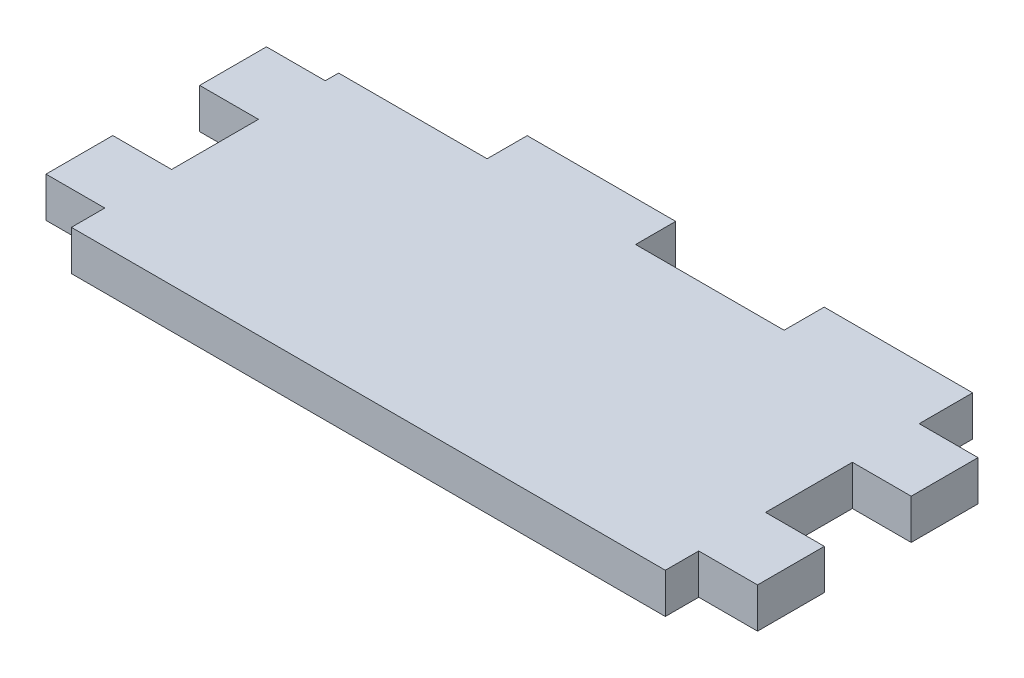
ISO-10303-21;
HEADER;
FILE_DESCRIPTION(('STEP AP214'),'2;1');
FILE_NAME('part.step','',(''),(''),'','','');
FILE_SCHEMA(('AUTOMOTIVE_DESIGN { 1 0 10303 214 1 1 1 1 }'));
ENDSEC;
DATA;
#1=APPLICATION_CONTEXT('core data for automotive mechanical design processes');
#2=APPLICATION_PROTOCOL_DEFINITION('international standard','automotive_design',2000,#1);
#3=PRODUCT_CONTEXT('',#1,'mechanical');
#4=PRODUCT('Part','Part','',(#3));
#5=PRODUCT_RELATED_PRODUCT_CATEGORY('part','',(#4));
#6=PRODUCT_DEFINITION_FORMATION('','',#4);
#7=PRODUCT_DEFINITION_CONTEXT('part definition',#1,'design');
#8=PRODUCT_DEFINITION('design','',#6,#7);
#9=PRODUCT_DEFINITION_SHAPE('','',#8);
#10=(LENGTH_UNIT() NAMED_UNIT(*) SI_UNIT(.MILLI.,.METRE.));
#11=(NAMED_UNIT(*) PLANE_ANGLE_UNIT() SI_UNIT($,.RADIAN.));
#12=(NAMED_UNIT(*) SI_UNIT($,.STERADIAN.) SOLID_ANGLE_UNIT());
#13=UNCERTAINTY_MEASURE_WITH_UNIT(LENGTH_MEASURE(1.E-05),#10,'distance_accuracy_value','');
#14=(GEOMETRIC_REPRESENTATION_CONTEXT(3) GLOBAL_UNCERTAINTY_ASSIGNED_CONTEXT((#13)) GLOBAL_UNIT_ASSIGNED_CONTEXT((#10,
#11,#12)) REPRESENTATION_CONTEXT('',''));
#15=CARTESIAN_POINT('',(0.,0.,0.));
#16=DIRECTION('',(0.,0.,1.));
#17=DIRECTION('',(1.,0.,0.));
#18=AXIS2_PLACEMENT_3D('',#15,#16,#17);
#19=CARTESIAN_POINT('',(-22.225,3.,-11.5));
#20=DIRECTION('',(0.,0.,1.));
#21=DIRECTION('',(1.,0.,0.));
#22=AXIS2_PLACEMENT_3D('',#19,#20,#21);
#23=PLANE('',#22);
#24=DIRECTION('',(-1.,0.,0.));
#25=VECTOR('',#24,1.);
#26=CARTESIAN_POINT('',(-22.225,3.,-11.5));
#27=LINE('',#26,#25);
#28=CARTESIAN_POINT('',(0.,3.,-11.5));
#29=VERTEX_POINT('',#28);
#30=CARTESIAN_POINT('',(-11.1125,3.,-11.5));
#31=VERTEX_POINT('',#30);
#32=EDGE_CURVE('E281',#29,#31,#27,.T.);
#33=ORIENTED_EDGE('',*,*,#32,.F.);
#34=DIRECTION('',(0.,1.,0.));
#35=VECTOR('',#34,1.);
#36=CARTESIAN_POINT('',(0.,0.,-11.5));
#37=LINE('',#36,#35);
#38=CARTESIAN_POINT('',(0.,0.,-11.5));
#39=VERTEX_POINT('',#38);
#40=EDGE_CURVE('E233',#39,#29,#37,.T.);
#41=ORIENTED_EDGE('',*,*,#40,.F.);
#42=DIRECTION('',(-1.,0.,0.));
#43=VECTOR('',#42,1.);
#44=CARTESIAN_POINT('',(-22.225,0.,-11.5));
#45=LINE('',#44,#43);
#46=CARTESIAN_POINT('',(-11.1125,0.,-11.5));
#47=VERTEX_POINT('',#46);
#48=EDGE_CURVE('E224',#39,#47,#45,.T.);
#49=ORIENTED_EDGE('',*,*,#48,.T.);
#50=DIRECTION('',(0.,1.,0.));
#51=VECTOR('',#50,1.);
#52=CARTESIAN_POINT('',(-11.1125,0.,-11.5));
#53=LINE('',#52,#51);
#54=EDGE_CURVE('E250',#47,#31,#53,.T.);
#55=ORIENTED_EDGE('',*,*,#54,.T.);
#56=EDGE_LOOP('',(#33,#41,#49,#55));
#57=FACE_BOUND('',#56,.T.);
#58=ADVANCED_FACE('F31',(#57),#23,.F.);
#59=CARTESIAN_POINT('',(-22.225,3.,11.5));
#60=DIRECTION('',(1.,0.,0.));
#61=DIRECTION('',(0.,0.,-1.));
#62=AXIS2_PLACEMENT_3D('',#59,#60,#61);
#63=PLANE('',#62);
#64=DIRECTION('',(0.,0.,1.));
#65=VECTOR('',#64,1.);
#66=CARTESIAN_POINT('',(-22.225,0.,11.5));
#67=LINE('',#66,#65);
#68=CARTESIAN_POINT('',(-22.225,0.,9.00000000000001));
#69=VERTEX_POINT('',#68);
#70=CARTESIAN_POINT('',(-22.225,0.,11.5));
#71=VERTEX_POINT('',#70);
#72=EDGE_CURVE('E253',#69,#71,#67,.T.);
#73=ORIENTED_EDGE('',*,*,#72,.T.);
#74=DIRECTION('',(0.,-1.,0.));
#75=VECTOR('',#74,1.);
#76=CARTESIAN_POINT('',(-22.225,3.,11.5));
#77=LINE('',#76,#75);
#78=CARTESIAN_POINT('',(-22.225,3.,11.5));
#79=VERTEX_POINT('',#78);
#80=EDGE_CURVE('E11',#79,#71,#77,.T.);
#81=ORIENTED_EDGE('',*,*,#80,.F.);
#82=DIRECTION('',(0.,0.,1.));
#83=VECTOR('',#82,1.);
#84=CARTESIAN_POINT('',(-22.225,3.,11.5));
#85=LINE('',#84,#83);
#86=CARTESIAN_POINT('',(-22.225,3.,9.00000000000001));
#87=VERTEX_POINT('',#86);
#88=EDGE_CURVE('E257',#87,#79,#85,.T.);
#89=ORIENTED_EDGE('',*,*,#88,.F.);
#90=DIRECTION('',(0.,-1.,0.));
#91=VECTOR('',#90,1.);
#92=CARTESIAN_POINT('',(-22.225,3.,9.00000000000001));
#93=LINE('',#92,#91);
#94=EDGE_CURVE('E301',#87,#69,#93,.T.);
#95=ORIENTED_EDGE('',*,*,#94,.T.);
#96=EDGE_LOOP('',(#73,#81,#89,#95));
#97=FACE_BOUND('',#96,.T.);
#98=ADVANCED_FACE('F33',(#97),#63,.F.);
#99=CARTESIAN_POINT('',(-22.225,3.,11.5));
#100=DIRECTION('',(0.,0.,-1.));
#101=DIRECTION('',(-1.,0.,0.));
#102=AXIS2_PLACEMENT_3D('',#99,#100,#101);
#103=PLANE('',#102);
#104=DIRECTION('',(1.,0.,0.));
#105=VECTOR('',#104,1.);
#106=CARTESIAN_POINT('',(-22.225,0.,11.5));
#107=LINE('',#106,#105);
#108=CARTESIAN_POINT('',(22.225,0.,11.5));
#109=VERTEX_POINT('',#108);
#110=EDGE_CURVE('E304',#71,#109,#107,.T.);
#111=ORIENTED_EDGE('',*,*,#110,.T.);
#112=DIRECTION('',(0.,-1.,0.));
#113=VECTOR('',#112,1.);
#114=CARTESIAN_POINT('',(22.225,3.,11.5));
#115=LINE('',#114,#113);
#116=CARTESIAN_POINT('',(22.225,3.,11.5));
#117=VERTEX_POINT('',#116);
#118=EDGE_CURVE('E39',#117,#109,#115,.T.);
#119=ORIENTED_EDGE('',*,*,#118,.F.);
#120=DIRECTION('',(1.,0.,0.));
#121=VECTOR('',#120,1.);
#122=CARTESIAN_POINT('',(-22.225,3.,11.5));
#123=LINE('',#122,#121);
#124=EDGE_CURVE('E260',#79,#117,#123,.T.);
#125=ORIENTED_EDGE('',*,*,#124,.F.);
#126=ORIENTED_EDGE('',*,*,#80,.T.);
#127=EDGE_LOOP('',(#111,#119,#125,#126));
#128=FACE_BOUND('',#127,.T.);
#129=ADVANCED_FACE('F417',(#128),#103,.F.);
#130=CARTESIAN_POINT('',(22.225,3.,11.5));
#131=DIRECTION('',(-1.,0.,0.));
#132=DIRECTION('',(0.,0.,1.));
#133=AXIS2_PLACEMENT_3D('',#130,#131,#132);
#134=PLANE('',#133);
#135=DIRECTION('',(0.,0.,-1.));
#136=VECTOR('',#135,1.);
#137=CARTESIAN_POINT('',(22.225,0.,11.5));
#138=LINE('',#137,#136);
#139=CARTESIAN_POINT('',(22.225,0.,9.00000000000001));
#140=VERTEX_POINT('',#139);
#141=EDGE_CURVE('E306',#109,#140,#138,.T.);
#142=ORIENTED_EDGE('',*,*,#141,.T.);
#143=DIRECTION('',(0.,-1.,0.));
#144=VECTOR('',#143,1.);
#145=CARTESIAN_POINT('',(22.225,3.,9.00000000000001));
#146=LINE('',#145,#144);
#147=CARTESIAN_POINT('',(22.225,3.,9.00000000000001));
#148=VERTEX_POINT('',#147);
#149=EDGE_CURVE('E389',#148,#140,#146,.T.);
#150=ORIENTED_EDGE('',*,*,#149,.F.);
#151=DIRECTION('',(0.,0.,-1.));
#152=VECTOR('',#151,1.);
#153=CARTESIAN_POINT('',(22.225,3.,11.5));
#154=LINE('',#153,#152);
#155=EDGE_CURVE('E263',#117,#148,#154,.T.);
#156=ORIENTED_EDGE('',*,*,#155,.F.);
#157=ORIENTED_EDGE('',*,*,#118,.T.);
#158=EDGE_LOOP('',(#142,#150,#156,#157));
#159=FACE_BOUND('',#158,.T.);
#160=ADVANCED_FACE('F396',(#159),#134,.F.);
#161=CARTESIAN_POINT('',(22.225,3.,9.00000000000001));
#162=DIRECTION('',(0.,0.,-1.));
#163=DIRECTION('',(-1.,0.,0.));
#164=AXIS2_PLACEMENT_3D('',#161,#162,#163);
#165=PLANE('',#164);
#166=DIRECTION('',(1.,0.,0.));
#167=VECTOR('',#166,1.);
#168=CARTESIAN_POINT('',(22.225,0.,9.00000000000001));
#169=LINE('',#168,#167);
#170=CARTESIAN_POINT('',(26.625,0.,9.00000000000001));
#171=VERTEX_POINT('',#170);
#172=EDGE_CURVE('E308',#140,#171,#169,.T.);
#173=ORIENTED_EDGE('',*,*,#172,.T.);
#174=DIRECTION('',(0.,-1.,0.));
#175=VECTOR('',#174,1.);
#176=CARTESIAN_POINT('',(26.625,3.,9.00000000000001));
#177=LINE('',#176,#175);
#178=CARTESIAN_POINT('',(26.625,3.,9.00000000000001));
#179=VERTEX_POINT('',#178);
#180=EDGE_CURVE('E386',#179,#171,#177,.T.);
#181=ORIENTED_EDGE('',*,*,#180,.F.);
#182=DIRECTION('',(1.,0.,0.));
#183=VECTOR('',#182,1.);
#184=CARTESIAN_POINT('',(22.225,3.,9.00000000000001));
#185=LINE('',#184,#183);
#186=EDGE_CURVE('E265',#148,#179,#185,.T.);
#187=ORIENTED_EDGE('',*,*,#186,.F.);
#188=ORIENTED_EDGE('',*,*,#149,.T.);
#189=EDGE_LOOP('',(#173,#181,#187,#188));
#190=FACE_BOUND('',#189,.T.);
#191=ADVANCED_FACE('F405',(#190),#165,.F.);
#192=CARTESIAN_POINT('',(26.625,3.,9.00000000000001));
#193=DIRECTION('',(-1.,0.,0.));
#194=DIRECTION('',(0.,0.,1.));
#195=AXIS2_PLACEMENT_3D('',#192,#193,#194);
#196=PLANE('',#195);
#197=DIRECTION('',(0.,0.,-1.));
#198=VECTOR('',#197,1.);
#199=CARTESIAN_POINT('',(26.625,0.,9.00000000000001));
#200=LINE('',#199,#198);
#201=CARTESIAN_POINT('',(26.625,0.,4.00000000000001));
#202=VERTEX_POINT('',#201);
#203=EDGE_CURVE('E310',#171,#202,#200,.T.);
#204=ORIENTED_EDGE('',*,*,#203,.T.);
#205=DIRECTION('',(0.,-1.,0.));
#206=VECTOR('',#205,1.);
#207=CARTESIAN_POINT('',(26.625,3.,4.00000000000001));
#208=LINE('',#207,#206);
#209=CARTESIAN_POINT('',(26.625,3.,4.00000000000001));
#210=VERTEX_POINT('',#209);
#211=EDGE_CURVE('E383',#210,#202,#208,.T.);
#212=ORIENTED_EDGE('',*,*,#211,.F.);
#213=DIRECTION('',(0.,0.,-1.));
#214=VECTOR('',#213,1.);
#215=CARTESIAN_POINT('',(26.625,3.,9.00000000000001));
#216=LINE('',#215,#214);
#217=EDGE_CURVE('E267',#179,#210,#216,.T.);
#218=ORIENTED_EDGE('',*,*,#217,.F.);
#219=ORIENTED_EDGE('',*,*,#180,.T.);
#220=EDGE_LOOP('',(#204,#212,#218,#219));
#221=FACE_BOUND('',#220,.T.);
#222=ADVANCED_FACE('F409',(#221),#196,.F.);
#223=CARTESIAN_POINT('',(22.225,3.,4.00000000000001));
#224=DIRECTION('',(0.,0.,1.));
#225=DIRECTION('',(1.,0.,0.));
#226=AXIS2_PLACEMENT_3D('',#223,#224,#225);
#227=PLANE('',#226);
#228=DIRECTION('',(-1.,0.,0.));
#229=VECTOR('',#228,1.);
#230=CARTESIAN_POINT('',(22.225,0.,4.00000000000001));
#231=LINE('',#230,#229);
#232=CARTESIAN_POINT('',(22.225,0.,4.00000000000001));
#233=VERTEX_POINT('',#232);
#234=EDGE_CURVE('E312',#202,#233,#231,.T.);
#235=ORIENTED_EDGE('',*,*,#234,.T.);
#236=DIRECTION('',(0.,-1.,0.));
#237=VECTOR('',#236,1.);
#238=CARTESIAN_POINT('',(22.225,3.,4.00000000000001));
#239=LINE('',#238,#237);
#240=CARTESIAN_POINT('',(22.225,3.,4.00000000000001));
#241=VERTEX_POINT('',#240);
#242=EDGE_CURVE('E380',#241,#233,#239,.T.);
#243=ORIENTED_EDGE('',*,*,#242,.F.);
#244=DIRECTION('',(-1.,0.,0.));
#245=VECTOR('',#244,1.);
#246=CARTESIAN_POINT('',(22.225,3.,4.00000000000001));
#247=LINE('',#246,#245);
#248=EDGE_CURVE('E269',#210,#241,#247,.T.);
#249=ORIENTED_EDGE('',*,*,#248,.F.);
#250=ORIENTED_EDGE('',*,*,#211,.T.);
#251=EDGE_LOOP('',(#235,#243,#249,#250));
#252=FACE_BOUND('',#251,.T.);
#253=ADVANCED_FACE('F499',(#252),#227,.F.);
#254=CARTESIAN_POINT('',(22.225,3.,4.00000000000001));
#255=DIRECTION('',(-1.,0.,0.));
#256=DIRECTION('',(0.,0.,1.));
#257=AXIS2_PLACEMENT_3D('',#254,#255,#256);
#258=PLANE('',#257);
#259=DIRECTION('',(0.,0.,-1.));
#260=VECTOR('',#259,1.);
#261=CARTESIAN_POINT('',(22.225,0.,4.00000000000001));
#262=LINE('',#261,#260);
#263=CARTESIAN_POINT('',(22.225,0.,-2.49999999999999));
#264=VERTEX_POINT('',#263);
#265=EDGE_CURVE('E314',#233,#264,#262,.T.);
#266=ORIENTED_EDGE('',*,*,#265,.T.);
#267=DIRECTION('',(0.,-1.,0.));
#268=VECTOR('',#267,1.);
#269=CARTESIAN_POINT('',(22.225,3.,-2.49999999999999));
#270=LINE('',#269,#268);
#271=CARTESIAN_POINT('',(22.225,3.,-2.49999999999999));
#272=VERTEX_POINT('',#271);
#273=EDGE_CURVE('E377',#272,#264,#270,.T.);
#274=ORIENTED_EDGE('',*,*,#273,.F.);
#275=DIRECTION('',(0.,0.,-1.));
#276=VECTOR('',#275,1.);
#277=CARTESIAN_POINT('',(22.225,3.,4.00000000000001));
#278=LINE('',#277,#276);
#279=EDGE_CURVE('E271',#241,#272,#278,.T.);
#280=ORIENTED_EDGE('',*,*,#279,.F.);
#281=ORIENTED_EDGE('',*,*,#242,.T.);
#282=EDGE_LOOP('',(#266,#274,#280,#281));
#283=FACE_BOUND('',#282,.T.);
#284=ADVANCED_FACE('F497',(#283),#258,.F.);
#285=CARTESIAN_POINT('',(22.225,3.,-2.49999999999999));
#286=DIRECTION('',(0.,0.,-1.));
#287=DIRECTION('',(-1.,0.,0.));
#288=AXIS2_PLACEMENT_3D('',#285,#286,#287);
#289=PLANE('',#288);
#290=DIRECTION('',(1.,0.,0.));
#291=VECTOR('',#290,1.);
#292=CARTESIAN_POINT('',(22.225,0.,-2.49999999999999));
#293=LINE('',#292,#291);
#294=CARTESIAN_POINT('',(26.625,0.,-2.49999999999999));
#295=VERTEX_POINT('',#294);
#296=EDGE_CURVE('E316',#264,#295,#293,.T.);
#297=ORIENTED_EDGE('',*,*,#296,.T.);
#298=DIRECTION('',(0.,-1.,0.));
#299=VECTOR('',#298,1.);
#300=CARTESIAN_POINT('',(26.625,3.,-2.49999999999999));
#301=LINE('',#300,#299);
#302=CARTESIAN_POINT('',(26.625,3.,-2.49999999999999));
#303=VERTEX_POINT('',#302);
#304=EDGE_CURVE('E374',#303,#295,#301,.T.);
#305=ORIENTED_EDGE('',*,*,#304,.F.);
#306=DIRECTION('',(1.,0.,0.));
#307=VECTOR('',#306,1.);
#308=CARTESIAN_POINT('',(22.225,3.,-2.49999999999999));
#309=LINE('',#308,#307);
#310=EDGE_CURVE('E273',#272,#303,#309,.T.);
#311=ORIENTED_EDGE('',*,*,#310,.F.);
#312=ORIENTED_EDGE('',*,*,#273,.T.);
#313=EDGE_LOOP('',(#297,#305,#311,#312));
#314=FACE_BOUND('',#313,.T.);
#315=ADVANCED_FACE('F492',(#314),#289,.F.);
#316=CARTESIAN_POINT('',(26.625,3.,-2.49999999999999));
#317=DIRECTION('',(-1.,0.,0.));
#318=DIRECTION('',(0.,0.,1.));
#319=AXIS2_PLACEMENT_3D('',#316,#317,#318);
#320=PLANE('',#319);
#321=DIRECTION('',(0.,0.,-1.));
#322=VECTOR('',#321,1.);
#323=CARTESIAN_POINT('',(26.625,0.,-2.49999999999999));
#324=LINE('',#323,#322);
#325=CARTESIAN_POINT('',(26.625,0.,-7.49999999999999));
#326=VERTEX_POINT('',#325);
#327=EDGE_CURVE('E318',#295,#326,#324,.T.);
#328=ORIENTED_EDGE('',*,*,#327,.T.);
#329=DIRECTION('',(0.,-1.,0.));
#330=VECTOR('',#329,1.);
#331=CARTESIAN_POINT('',(26.625,3.,-7.49999999999999));
#332=LINE('',#331,#330);
#333=CARTESIAN_POINT('',(26.625,3.,-7.49999999999999));
#334=VERTEX_POINT('',#333);
#335=EDGE_CURVE('E371',#334,#326,#332,.T.);
#336=ORIENTED_EDGE('',*,*,#335,.F.);
#337=DIRECTION('',(0.,0.,-1.));
#338=VECTOR('',#337,1.);
#339=CARTESIAN_POINT('',(26.625,3.,-2.49999999999999));
#340=LINE('',#339,#338);
#341=EDGE_CURVE('E275',#303,#334,#340,.T.);
#342=ORIENTED_EDGE('',*,*,#341,.F.);
#343=ORIENTED_EDGE('',*,*,#304,.T.);
#344=EDGE_LOOP('',(#328,#336,#342,#343));
#345=FACE_BOUND('',#344,.T.);
#346=ADVANCED_FACE('F487',(#345),#320,.F.);
#347=CARTESIAN_POINT('',(22.225,3.,-7.49999999999999));
#348=DIRECTION('',(0.,0.,1.));
#349=DIRECTION('',(1.,0.,0.));
#350=AXIS2_PLACEMENT_3D('',#347,#348,#349);
#351=PLANE('',#350);
#352=DIRECTION('',(-1.,0.,0.));
#353=VECTOR('',#352,1.);
#354=CARTESIAN_POINT('',(22.225,0.,-7.49999999999999));
#355=LINE('',#354,#353);
#356=CARTESIAN_POINT('',(22.225,0.,-7.49999999999999));
#357=VERTEX_POINT('',#356);
#358=EDGE_CURVE('E320',#326,#357,#355,.T.);
#359=ORIENTED_EDGE('',*,*,#358,.T.);
#360=DIRECTION('',(0.,-1.,0.));
#361=VECTOR('',#360,1.);
#362=CARTESIAN_POINT('',(22.225,3.,-7.49999999999999));
#363=LINE('',#362,#361);
#364=CARTESIAN_POINT('',(22.225,3.,-7.49999999999999));
#365=VERTEX_POINT('',#364);
#366=EDGE_CURVE('E368',#365,#357,#363,.T.);
#367=ORIENTED_EDGE('',*,*,#366,.F.);
#368=DIRECTION('',(-1.,0.,0.));
#369=VECTOR('',#368,1.);
#370=CARTESIAN_POINT('',(22.225,3.,-7.49999999999999));
#371=LINE('',#370,#369);
#372=EDGE_CURVE('E277',#334,#365,#371,.T.);
#373=ORIENTED_EDGE('',*,*,#372,.F.);
#374=ORIENTED_EDGE('',*,*,#335,.T.);
#375=EDGE_LOOP('',(#359,#367,#373,#374));
#376=FACE_BOUND('',#375,.T.);
#377=ADVANCED_FACE('F483',(#376),#351,.F.);
#378=CARTESIAN_POINT('',(22.225,3.,-7.49999999999999));
#379=DIRECTION('',(-1.,0.,0.));
#380=DIRECTION('',(0.,0.,1.));
#381=AXIS2_PLACEMENT_3D('',#378,#379,#380);
#382=PLANE('',#381);
#383=DIRECTION('',(0.,0.,-1.));
#384=VECTOR('',#383,1.);
#385=CARTESIAN_POINT('',(22.225,0.,-7.49999999999999));
#386=LINE('',#385,#384);
#387=CARTESIAN_POINT('',(22.225,0.,-11.5));
#388=VERTEX_POINT('',#387);
#389=EDGE_CURVE('E322',#357,#388,#386,.T.);
#390=ORIENTED_EDGE('',*,*,#389,.T.);
#391=DIRECTION('',(0.,-1.,0.));
#392=VECTOR('',#391,1.);
#393=CARTESIAN_POINT('',(22.225,3.,-11.5));
#394=LINE('',#393,#392);
#395=CARTESIAN_POINT('',(22.225,3.,-11.5));
#396=VERTEX_POINT('',#395);
#397=EDGE_CURVE('E365',#396,#388,#394,.T.);
#398=ORIENTED_EDGE('',*,*,#397,.F.);
#399=DIRECTION('',(0.,0.,-1.));
#400=VECTOR('',#399,1.);
#401=CARTESIAN_POINT('',(22.225,3.,-7.49999999999999));
#402=LINE('',#401,#400);
#403=EDGE_CURVE('E279',#365,#396,#402,.T.);
#404=ORIENTED_EDGE('',*,*,#403,.F.);
#405=ORIENTED_EDGE('',*,*,#366,.T.);
#406=EDGE_LOOP('',(#390,#398,#404,#405));
#407=FACE_BOUND('',#406,.T.);
#408=ADVANCED_FACE('F478',(#407),#382,.F.);
#409=CARTESIAN_POINT('',(11.1125,0.,-11.5));
#410=VERTEX_POINT('',#409);
#411=EDGE_CURVE('E324',#388,#410,#45,.T.);
#412=ORIENTED_EDGE('',*,*,#411,.T.);
#413=DIRECTION('',(0.,1.,0.));
#414=VECTOR('',#413,1.);
#415=CARTESIAN_POINT('',(11.1125,0.,-11.5));
#416=LINE('',#415,#414);
#417=CARTESIAN_POINT('',(11.1125,3.,-11.5));
#418=VERTEX_POINT('',#417);
#419=EDGE_CURVE('E236',#410,#418,#416,.T.);
#420=ORIENTED_EDGE('',*,*,#419,.T.);
#421=EDGE_CURVE('E282',#396,#418,#27,.T.);
#422=ORIENTED_EDGE('',*,*,#421,.F.);
#423=ORIENTED_EDGE('',*,*,#397,.T.);
#424=EDGE_LOOP('',(#412,#420,#422,#423));
#425=FACE_BOUND('',#424,.T.);
#426=ADVANCED_FACE('F471',(#425),#23,.F.);
#427=CARTESIAN_POINT('',(-22.225,3.,-7.49999999999999));
#428=DIRECTION('',(1.,0.,0.));
#429=DIRECTION('',(0.,0.,-1.));
#430=AXIS2_PLACEMENT_3D('',#427,#428,#429);
#431=PLANE('',#430);
#432=DIRECTION('',(0.,0.,1.));
#433=VECTOR('',#432,1.);
#434=CARTESIAN_POINT('',(-22.225,3.,-7.49999999999999));
#435=LINE('',#434,#433);
#436=CARTESIAN_POINT('',(-22.225,3.,-8.49999999999999));
#437=VERTEX_POINT('',#436);
#438=CARTESIAN_POINT('',(-22.225,3.,-7.49999999999999));
#439=VERTEX_POINT('',#438);
#440=EDGE_CURVE('E285',#437,#439,#435,.T.);
#441=ORIENTED_EDGE('',*,*,#440,.F.);
#442=DIRECTION('',(0.,1.,0.));
#443=VECTOR('',#442,1.);
#444=CARTESIAN_POINT('',(-22.225,0.,-8.49999999999999));
#445=LINE('',#444,#443);
#446=CARTESIAN_POINT('',(-22.225,0.,-8.49999999999999));
#447=VERTEX_POINT('',#446);
#448=EDGE_CURVE('E245',#447,#437,#445,.T.);
#449=ORIENTED_EDGE('',*,*,#448,.F.);
#450=DIRECTION('',(0.,0.,1.));
#451=VECTOR('',#450,1.);
#452=CARTESIAN_POINT('',(-22.225,0.,-7.49999999999999));
#453=LINE('',#452,#451);
#454=CARTESIAN_POINT('',(-22.225,0.,-7.49999999999999));
#455=VERTEX_POINT('',#454);
#456=EDGE_CURVE('E327',#447,#455,#453,.T.);
#457=ORIENTED_EDGE('',*,*,#456,.T.);
#458=DIRECTION('',(0.,-1.,0.));
#459=VECTOR('',#458,1.);
#460=CARTESIAN_POINT('',(-22.225,3.,-7.49999999999999));
#461=LINE('',#460,#459);
#462=EDGE_CURVE('E362',#439,#455,#461,.T.);
#463=ORIENTED_EDGE('',*,*,#462,.F.);
#464=EDGE_LOOP('',(#441,#449,#457,#463));
#465=FACE_BOUND('',#464,.T.);
#466=ADVANCED_FACE('F458',(#465),#431,.F.);
#467=CARTESIAN_POINT('',(-22.225,3.,-7.49999999999999));
#468=DIRECTION('',(0.,0.,1.));
#469=DIRECTION('',(1.,0.,0.));
#470=AXIS2_PLACEMENT_3D('',#467,#468,#469);
#471=PLANE('',#470);
#472=DIRECTION('',(-1.,0.,0.));
#473=VECTOR('',#472,1.);
#474=CARTESIAN_POINT('',(-22.225,0.,-7.49999999999999));
#475=LINE('',#474,#473);
#476=CARTESIAN_POINT('',(-26.625,0.,-7.49999999999999));
#477=VERTEX_POINT('',#476);
#478=EDGE_CURVE('E329',#455,#477,#475,.T.);
#479=ORIENTED_EDGE('',*,*,#478,.T.);
#480=DIRECTION('',(0.,-1.,0.));
#481=VECTOR('',#480,1.);
#482=CARTESIAN_POINT('',(-26.625,3.,-7.49999999999999));
#483=LINE('',#482,#481);
#484=CARTESIAN_POINT('',(-26.625,3.,-7.49999999999999));
#485=VERTEX_POINT('',#484);
#486=EDGE_CURVE('E359',#485,#477,#483,.T.);
#487=ORIENTED_EDGE('',*,*,#486,.F.);
#488=DIRECTION('',(-1.,0.,0.));
#489=VECTOR('',#488,1.);
#490=CARTESIAN_POINT('',(-22.225,3.,-7.49999999999999));
#491=LINE('',#490,#489);
#492=EDGE_CURVE('E287',#439,#485,#491,.T.);
#493=ORIENTED_EDGE('',*,*,#492,.F.);
#494=ORIENTED_EDGE('',*,*,#462,.T.);
#495=EDGE_LOOP('',(#479,#487,#493,#494));
#496=FACE_BOUND('',#495,.T.);
#497=ADVANCED_FACE('F453',(#496),#471,.F.);
#498=CARTESIAN_POINT('',(-26.625,3.,-2.49999999999999));
#499=DIRECTION('',(1.,0.,0.));
#500=DIRECTION('',(0.,0.,-1.));
#501=AXIS2_PLACEMENT_3D('',#498,#499,#500);
#502=PLANE('',#501);
#503=DIRECTION('',(0.,0.,1.));
#504=VECTOR('',#503,1.);
#505=CARTESIAN_POINT('',(-26.625,0.,-2.49999999999999));
#506=LINE('',#505,#504);
#507=CARTESIAN_POINT('',(-26.625,0.,-2.49999999999999));
#508=VERTEX_POINT('',#507);
#509=EDGE_CURVE('E331',#477,#508,#506,.T.);
#510=ORIENTED_EDGE('',*,*,#509,.T.);
#511=DIRECTION('',(0.,-1.,0.));
#512=VECTOR('',#511,1.);
#513=CARTESIAN_POINT('',(-26.625,3.,-2.49999999999999));
#514=LINE('',#513,#512);
#515=CARTESIAN_POINT('',(-26.625,3.,-2.49999999999999));
#516=VERTEX_POINT('',#515);
#517=EDGE_CURVE('E356',#516,#508,#514,.T.);
#518=ORIENTED_EDGE('',*,*,#517,.F.);
#519=DIRECTION('',(0.,0.,1.));
#520=VECTOR('',#519,1.);
#521=CARTESIAN_POINT('',(-26.625,3.,-2.49999999999999));
#522=LINE('',#521,#520);
#523=EDGE_CURVE('E289',#485,#516,#522,.T.);
#524=ORIENTED_EDGE('',*,*,#523,.F.);
#525=ORIENTED_EDGE('',*,*,#486,.T.);
#526=EDGE_LOOP('',(#510,#518,#524,#525));
#527=FACE_BOUND('',#526,.T.);
#528=ADVANCED_FACE('F448',(#527),#502,.F.);
#529=CARTESIAN_POINT('',(-22.225,3.,-2.49999999999999));
#530=DIRECTION('',(0.,0.,-1.));
#531=DIRECTION('',(-1.,0.,0.));
#532=AXIS2_PLACEMENT_3D('',#529,#530,#531);
#533=PLANE('',#532);
#534=DIRECTION('',(1.,0.,0.));
#535=VECTOR('',#534,1.);
#536=CARTESIAN_POINT('',(-22.225,0.,-2.49999999999999));
#537=LINE('',#536,#535);
#538=CARTESIAN_POINT('',(-22.225,0.,-2.49999999999999));
#539=VERTEX_POINT('',#538);
#540=EDGE_CURVE('E333',#508,#539,#537,.T.);
#541=ORIENTED_EDGE('',*,*,#540,.T.);
#542=DIRECTION('',(0.,-1.,0.));
#543=VECTOR('',#542,1.);
#544=CARTESIAN_POINT('',(-22.225,3.,-2.49999999999999));
#545=LINE('',#544,#543);
#546=CARTESIAN_POINT('',(-22.225,3.,-2.49999999999999));
#547=VERTEX_POINT('',#546);
#548=EDGE_CURVE('E353',#547,#539,#545,.T.);
#549=ORIENTED_EDGE('',*,*,#548,.F.);
#550=DIRECTION('',(1.,0.,0.));
#551=VECTOR('',#550,1.);
#552=CARTESIAN_POINT('',(-22.225,3.,-2.49999999999999));
#553=LINE('',#552,#551);
#554=EDGE_CURVE('E291',#516,#547,#553,.T.);
#555=ORIENTED_EDGE('',*,*,#554,.F.);
#556=ORIENTED_EDGE('',*,*,#517,.T.);
#557=EDGE_LOOP('',(#541,#549,#555,#556));
#558=FACE_BOUND('',#557,.T.);
#559=ADVANCED_FACE('F444',(#558),#533,.F.);
#560=CARTESIAN_POINT('',(-22.225,3.,4.00000000000001));
#561=DIRECTION('',(1.,0.,0.));
#562=DIRECTION('',(0.,0.,-1.));
#563=AXIS2_PLACEMENT_3D('',#560,#561,#562);
#564=PLANE('',#563);
#565=DIRECTION('',(0.,0.,1.));
#566=VECTOR('',#565,1.);
#567=CARTESIAN_POINT('',(-22.225,0.,4.00000000000001));
#568=LINE('',#567,#566);
#569=CARTESIAN_POINT('',(-22.225,0.,4.00000000000001));
#570=VERTEX_POINT('',#569);
#571=EDGE_CURVE('E335',#539,#570,#568,.T.);
#572=ORIENTED_EDGE('',*,*,#571,.T.);
#573=DIRECTION('',(0.,-1.,0.));
#574=VECTOR('',#573,1.);
#575=CARTESIAN_POINT('',(-22.225,3.,4.00000000000001));
#576=LINE('',#575,#574);
#577=CARTESIAN_POINT('',(-22.225,3.,4.00000000000001));
#578=VERTEX_POINT('',#577);
#579=EDGE_CURVE('E350',#578,#570,#576,.T.);
#580=ORIENTED_EDGE('',*,*,#579,.F.);
#581=DIRECTION('',(0.,0.,1.));
#582=VECTOR('',#581,1.);
#583=CARTESIAN_POINT('',(-22.225,3.,4.00000000000001));
#584=LINE('',#583,#582);
#585=EDGE_CURVE('E293',#547,#578,#584,.T.);
#586=ORIENTED_EDGE('',*,*,#585,.F.);
#587=ORIENTED_EDGE('',*,*,#548,.T.);
#588=EDGE_LOOP('',(#572,#580,#586,#587));
#589=FACE_BOUND('',#588,.T.);
#590=ADVANCED_FACE('F439',(#589),#564,.F.);
#591=CARTESIAN_POINT('',(-22.225,3.,4.00000000000001));
#592=DIRECTION('',(0.,0.,1.));
#593=DIRECTION('',(1.,0.,0.));
#594=AXIS2_PLACEMENT_3D('',#591,#592,#593);
#595=PLANE('',#594);
#596=DIRECTION('',(-1.,0.,0.));
#597=VECTOR('',#596,1.);
#598=CARTESIAN_POINT('',(-22.225,0.,4.00000000000001));
#599=LINE('',#598,#597);
#600=CARTESIAN_POINT('',(-26.625,0.,4.00000000000001));
#601=VERTEX_POINT('',#600);
#602=EDGE_CURVE('E337',#570,#601,#599,.T.);
#603=ORIENTED_EDGE('',*,*,#602,.T.);
#604=DIRECTION('',(0.,-1.,0.));
#605=VECTOR('',#604,1.);
#606=CARTESIAN_POINT('',(-26.625,3.,4.00000000000001));
#607=LINE('',#606,#605);
#608=CARTESIAN_POINT('',(-26.625,3.,4.00000000000001));
#609=VERTEX_POINT('',#608);
#610=EDGE_CURVE('E347',#609,#601,#607,.T.);
#611=ORIENTED_EDGE('',*,*,#610,.F.);
#612=DIRECTION('',(-1.,0.,0.));
#613=VECTOR('',#612,1.);
#614=CARTESIAN_POINT('',(-22.225,3.,4.00000000000001));
#615=LINE('',#614,#613);
#616=EDGE_CURVE('E295',#578,#609,#615,.T.);
#617=ORIENTED_EDGE('',*,*,#616,.F.);
#618=ORIENTED_EDGE('',*,*,#579,.T.);
#619=EDGE_LOOP('',(#603,#611,#617,#618));
#620=FACE_BOUND('',#619,.T.);
#621=ADVANCED_FACE('F433',(#620),#595,.F.);
#622=CARTESIAN_POINT('',(-26.625,3.,9.00000000000001));
#623=DIRECTION('',(1.,0.,0.));
#624=DIRECTION('',(0.,0.,-1.));
#625=AXIS2_PLACEMENT_3D('',#622,#623,#624);
#626=PLANE('',#625);
#627=DIRECTION('',(0.,0.,1.));
#628=VECTOR('',#627,1.);
#629=CARTESIAN_POINT('',(-26.625,0.,9.00000000000001));
#630=LINE('',#629,#628);
#631=CARTESIAN_POINT('',(-26.625,0.,9.00000000000001));
#632=VERTEX_POINT('',#631);
#633=EDGE_CURVE('E339',#601,#632,#630,.T.);
#634=ORIENTED_EDGE('',*,*,#633,.T.);
#635=DIRECTION('',(0.,-1.,0.));
#636=VECTOR('',#635,1.);
#637=CARTESIAN_POINT('',(-26.625,3.,9.00000000000001));
#638=LINE('',#637,#636);
#639=CARTESIAN_POINT('',(-26.625,3.,9.00000000000001));
#640=VERTEX_POINT('',#639);
#641=EDGE_CURVE('E344',#640,#632,#638,.T.);
#642=ORIENTED_EDGE('',*,*,#641,.F.);
#643=DIRECTION('',(0.,0.,1.));
#644=VECTOR('',#643,1.);
#645=CARTESIAN_POINT('',(-26.625,3.,9.00000000000001));
#646=LINE('',#645,#644);
#647=EDGE_CURVE('E297',#609,#640,#646,.T.);
#648=ORIENTED_EDGE('',*,*,#647,.F.);
#649=ORIENTED_EDGE('',*,*,#610,.T.);
#650=EDGE_LOOP('',(#634,#642,#648,#649));
#651=FACE_BOUND('',#650,.T.);
#652=ADVANCED_FACE('F429',(#651),#626,.F.);
#653=CARTESIAN_POINT('',(-22.225,3.,9.00000000000001));
#654=DIRECTION('',(0.,0.,-1.));
#655=DIRECTION('',(-1.,0.,0.));
#656=AXIS2_PLACEMENT_3D('',#653,#654,#655);
#657=PLANE('',#656);
#658=DIRECTION('',(1.,0.,0.));
#659=VECTOR('',#658,1.);
#660=CARTESIAN_POINT('',(-22.225,0.,9.00000000000001));
#661=LINE('',#660,#659);
#662=EDGE_CURVE('E261',#632,#69,#661,.T.);
#663=ORIENTED_EDGE('',*,*,#662,.T.);
#664=ORIENTED_EDGE('',*,*,#94,.F.);
#665=DIRECTION('',(1.,0.,0.));
#666=VECTOR('',#665,1.);
#667=CARTESIAN_POINT('',(-22.225,3.,9.00000000000001));
#668=LINE('',#667,#666);
#669=EDGE_CURVE('E299',#640,#87,#668,.T.);
#670=ORIENTED_EDGE('',*,*,#669,.F.);
#671=ORIENTED_EDGE('',*,*,#641,.T.);
#672=EDGE_LOOP('',(#663,#664,#670,#671));
#673=FACE_BOUND('',#672,.T.);
#674=ADVANCED_FACE('F424',(#673),#657,.F.);
#675=CARTESIAN_POINT('',(-22.225,3.,9.00000000000001));
#676=DIRECTION('',(0.,1.,0.));
#677=DIRECTION('',(0.,0.,1.));
#678=AXIS2_PLACEMENT_3D('',#675,#676,#677);
#679=PLANE('',#678);
#680=DIRECTION('',(0.,0.,1.));
#681=VECTOR('',#680,1.);
#682=CARTESIAN_POINT('',(0.,3.,-11.5));
#683=LINE('',#682,#681);
#684=CARTESIAN_POINT('',(0.,3.,-8.49999999999999));
#685=VERTEX_POINT('',#684);
#686=EDGE_CURVE('E211',#29,#685,#683,.T.);
#687=ORIENTED_EDGE('',*,*,#686,.F.);
#688=ORIENTED_EDGE('',*,*,#32,.T.);
#689=DIRECTION('',(0.,0.,-1.));
#690=VECTOR('',#689,1.);
#691=CARTESIAN_POINT('',(-11.1125,3.,-11.5));
#692=LINE('',#691,#690);
#693=CARTESIAN_POINT('',(-11.1125,3.,-8.49999999999999));
#694=VERTEX_POINT('',#693);
#695=EDGE_CURVE('E243',#694,#31,#692,.T.);
#696=ORIENTED_EDGE('',*,*,#695,.F.);
#697=DIRECTION('',(1.,0.,0.));
#698=VECTOR('',#697,1.);
#699=CARTESIAN_POINT('',(-22.225,3.,-8.49999999999999));
#700=LINE('',#699,#698);
#701=EDGE_CURVE('E235',#437,#694,#700,.T.);
#702=ORIENTED_EDGE('',*,*,#701,.F.);
#703=ORIENTED_EDGE('',*,*,#440,.T.);
#704=ORIENTED_EDGE('',*,*,#492,.T.);
#705=ORIENTED_EDGE('',*,*,#523,.T.);
#706=ORIENTED_EDGE('',*,*,#554,.T.);
#707=ORIENTED_EDGE('',*,*,#585,.T.);
#708=ORIENTED_EDGE('',*,*,#616,.T.);
#709=ORIENTED_EDGE('',*,*,#647,.T.);
#710=ORIENTED_EDGE('',*,*,#669,.T.);
#711=ORIENTED_EDGE('',*,*,#88,.T.);
#712=ORIENTED_EDGE('',*,*,#124,.T.);
#713=ORIENTED_EDGE('',*,*,#155,.T.);
#714=ORIENTED_EDGE('',*,*,#186,.T.);
#715=ORIENTED_EDGE('',*,*,#217,.T.);
#716=ORIENTED_EDGE('',*,*,#248,.T.);
#717=ORIENTED_EDGE('',*,*,#279,.T.);
#718=ORIENTED_EDGE('',*,*,#310,.T.);
#719=ORIENTED_EDGE('',*,*,#341,.T.);
#720=ORIENTED_EDGE('',*,*,#372,.T.);
#721=ORIENTED_EDGE('',*,*,#403,.T.);
#722=ORIENTED_EDGE('',*,*,#421,.T.);
#723=DIRECTION('',(0.,0.,-1.));
#724=VECTOR('',#723,1.);
#725=CARTESIAN_POINT('',(11.1125,3.,-11.5));
#726=LINE('',#725,#724);
#727=CARTESIAN_POINT('',(11.1125,3.,-8.49999999999999));
#728=VERTEX_POINT('',#727);
#729=EDGE_CURVE('E225',#728,#418,#726,.T.);
#730=ORIENTED_EDGE('',*,*,#729,.F.);
#731=DIRECTION('',(1.,0.,0.));
#732=VECTOR('',#731,1.);
#733=CARTESIAN_POINT('',(0.,3.,-8.49999999999999));
#734=LINE('',#733,#732);
#735=EDGE_CURVE('E227',#685,#728,#734,.T.);
#736=ORIENTED_EDGE('',*,*,#735,.F.);
#737=EDGE_LOOP('',(#687,#688,#696,#702,#703,#704,#705,#706,#707,#708,#709,#710,#711,#712,#713,
#714,#715,#716,#717,#718,#719,#720,#721,#722,#730,#736));
#738=FACE_BOUND('',#737,.T.);
#739=ADVANCED_FACE('F413',(#738),#679,.T.);
#740=CARTESIAN_POINT('',(-22.225,0.,9.00000000000001));
#741=DIRECTION('',(0.,1.,0.));
#742=DIRECTION('',(0.,0.,1.));
#743=AXIS2_PLACEMENT_3D('',#740,#741,#742);
#744=PLANE('',#743);
#745=ORIENTED_EDGE('',*,*,#48,.F.);
#746=DIRECTION('',(0.,0.,1.));
#747=VECTOR('',#746,1.);
#748=CARTESIAN_POINT('',(0.,0.,-11.5));
#749=LINE('',#748,#747);
#750=CARTESIAN_POINT('',(0.,0.,-8.49999999999999));
#751=VERTEX_POINT('',#750);
#752=EDGE_CURVE('E208',#39,#751,#749,.T.);
#753=ORIENTED_EDGE('',*,*,#752,.T.);
#754=DIRECTION('',(1.,0.,0.));
#755=VECTOR('',#754,1.);
#756=CARTESIAN_POINT('',(0.,0.,-8.49999999999999));
#757=LINE('',#756,#755);
#758=CARTESIAN_POINT('',(11.1125,0.,-8.49999999999999));
#759=VERTEX_POINT('',#758);
#760=EDGE_CURVE('E218',#751,#759,#757,.T.);
#761=ORIENTED_EDGE('',*,*,#760,.T.);
#762=DIRECTION('',(0.,0.,-1.));
#763=VECTOR('',#762,1.);
#764=CARTESIAN_POINT('',(11.1125,0.,-11.5));
#765=LINE('',#764,#763);
#766=EDGE_CURVE('E46',#759,#410,#765,.T.);
#767=ORIENTED_EDGE('',*,*,#766,.T.);
#768=ORIENTED_EDGE('',*,*,#411,.F.);
#769=ORIENTED_EDGE('',*,*,#389,.F.);
#770=ORIENTED_EDGE('',*,*,#358,.F.);
#771=ORIENTED_EDGE('',*,*,#327,.F.);
#772=ORIENTED_EDGE('',*,*,#296,.F.);
#773=ORIENTED_EDGE('',*,*,#265,.F.);
#774=ORIENTED_EDGE('',*,*,#234,.F.);
#775=ORIENTED_EDGE('',*,*,#203,.F.);
#776=ORIENTED_EDGE('',*,*,#172,.F.);
#777=ORIENTED_EDGE('',*,*,#141,.F.);
#778=ORIENTED_EDGE('',*,*,#110,.F.);
#779=ORIENTED_EDGE('',*,*,#72,.F.);
#780=ORIENTED_EDGE('',*,*,#662,.F.);
#781=ORIENTED_EDGE('',*,*,#633,.F.);
#782=ORIENTED_EDGE('',*,*,#602,.F.);
#783=ORIENTED_EDGE('',*,*,#571,.F.);
#784=ORIENTED_EDGE('',*,*,#540,.F.);
#785=ORIENTED_EDGE('',*,*,#509,.F.);
#786=ORIENTED_EDGE('',*,*,#478,.F.);
#787=ORIENTED_EDGE('',*,*,#456,.F.);
#788=DIRECTION('',(1.,0.,0.));
#789=VECTOR('',#788,1.);
#790=CARTESIAN_POINT('',(-22.225,0.,-8.49999999999999));
#791=LINE('',#790,#789);
#792=CARTESIAN_POINT('',(-11.1125,0.,-8.49999999999999));
#793=VERTEX_POINT('',#792);
#794=EDGE_CURVE('E240',#447,#793,#791,.T.);
#795=ORIENTED_EDGE('',*,*,#794,.T.);
#796=DIRECTION('',(0.,0.,-1.));
#797=VECTOR('',#796,1.);
#798=CARTESIAN_POINT('',(-11.1125,0.,-11.5));
#799=LINE('',#798,#797);
#800=EDGE_CURVE('E54',#793,#47,#799,.T.);
#801=ORIENTED_EDGE('',*,*,#800,.T.);
#802=EDGE_LOOP('',(#745,#753,#761,#767,#768,#769,#770,#771,#772,#773,#774,#775,#776,#777,#778,
#779,#780,#781,#782,#783,#784,#785,#786,#787,#795,#801));
#803=FACE_BOUND('',#802,.T.);
#804=ADVANCED_FACE('F223',(#803),#744,.F.);
#805=CARTESIAN_POINT('',(-11.1125,0.,-11.5));
#806=DIRECTION('',(1.,0.,0.));
#807=DIRECTION('',(0.,0.,-1.));
#808=AXIS2_PLACEMENT_3D('',#805,#806,#807);
#809=PLANE('',#808);
#810=ORIENTED_EDGE('',*,*,#695,.T.);
#811=ORIENTED_EDGE('',*,*,#54,.F.);
#812=ORIENTED_EDGE('',*,*,#800,.F.);
#813=DIRECTION('',(0.,1.,0.));
#814=VECTOR('',#813,1.);
#815=CARTESIAN_POINT('',(-11.1125,0.,-8.49999999999999));
#816=LINE('',#815,#814);
#817=EDGE_CURVE('E254',#793,#694,#816,.T.);
#818=ORIENTED_EDGE('',*,*,#817,.T.);
#819=EDGE_LOOP('',(#810,#811,#812,#818));
#820=FACE_BOUND('',#819,.T.);
#821=ADVANCED_FACE('F465',(#820),#809,.F.);
#822=CARTESIAN_POINT('',(-22.225,0.,-8.49999999999999));
#823=DIRECTION('',(0.,0.,1.));
#824=DIRECTION('',(1.,0.,0.));
#825=AXIS2_PLACEMENT_3D('',#822,#823,#824);
#826=PLANE('',#825);
#827=ORIENTED_EDGE('',*,*,#701,.T.);
#828=ORIENTED_EDGE('',*,*,#817,.F.);
#829=ORIENTED_EDGE('',*,*,#794,.F.);
#830=ORIENTED_EDGE('',*,*,#448,.T.);
#831=EDGE_LOOP('',(#827,#828,#829,#830));
#832=FACE_BOUND('',#831,.T.);
#833=ADVANCED_FACE('F462',(#832),#826,.F.);
#834=CARTESIAN_POINT('',(0.,0.,-11.5));
#835=DIRECTION('',(-1.,0.,0.));
#836=DIRECTION('',(0.,0.,1.));
#837=AXIS2_PLACEMENT_3D('',#834,#835,#836);
#838=PLANE('',#837);
#839=ORIENTED_EDGE('',*,*,#686,.T.);
#840=DIRECTION('',(0.,1.,0.));
#841=VECTOR('',#840,1.);
#842=CARTESIAN_POINT('',(0.,0.,-8.49999999999999));
#843=LINE('',#842,#841);
#844=EDGE_CURVE('E204',#751,#685,#843,.T.);
#845=ORIENTED_EDGE('',*,*,#844,.F.);
#846=ORIENTED_EDGE('',*,*,#752,.F.);
#847=ORIENTED_EDGE('',*,*,#40,.T.);
#848=EDGE_LOOP('',(#839,#845,#846,#847));
#849=FACE_BOUND('',#848,.T.);
#850=ADVANCED_FACE('F206',(#849),#838,.F.);
#851=CARTESIAN_POINT('',(11.1125,0.,-11.5));
#852=DIRECTION('',(1.,0.,0.));
#853=DIRECTION('',(0.,0.,-1.));
#854=AXIS2_PLACEMENT_3D('',#851,#852,#853);
#855=PLANE('',#854);
#856=ORIENTED_EDGE('',*,*,#729,.T.);
#857=ORIENTED_EDGE('',*,*,#419,.F.);
#858=ORIENTED_EDGE('',*,*,#766,.F.);
#859=DIRECTION('',(0.,1.,0.));
#860=VECTOR('',#859,1.);
#861=CARTESIAN_POINT('',(11.1125,0.,-8.49999999999999));
#862=LINE('',#861,#860);
#863=EDGE_CURVE('E215',#759,#728,#862,.T.);
#864=ORIENTED_EDGE('',*,*,#863,.T.);
#865=EDGE_LOOP('',(#856,#857,#858,#864));
#866=FACE_BOUND('',#865,.T.);
#867=ADVANCED_FACE('F469',(#866),#855,.F.);
#868=CARTESIAN_POINT('',(0.,0.,-8.49999999999999));
#869=DIRECTION('',(0.,0.,1.));
#870=DIRECTION('',(1.,0.,0.));
#871=AXIS2_PLACEMENT_3D('',#868,#869,#870);
#872=PLANE('',#871);
#873=ORIENTED_EDGE('',*,*,#735,.T.);
#874=ORIENTED_EDGE('',*,*,#863,.F.);
#875=ORIENTED_EDGE('',*,*,#760,.F.);
#876=ORIENTED_EDGE('',*,*,#844,.T.);
#877=EDGE_LOOP('',(#873,#874,#875,#876));
#878=FACE_BOUND('',#877,.T.);
#879=ADVANCED_FACE('F219',(#878),#872,.F.);
#880=CLOSED_SHELL('',(#58,#98,#129,#160,#191,#222,#253,#284,#315,#346,#377,#408,#426,#466,#497,
#528,#559,#590,#621,#652,#674,#739,#804,#821,#833,#850,#867,#879));
#881=MANIFOLD_SOLID_BREP('B2',#880);
#882=ADVANCED_BREP_SHAPE_REPRESENTATION('',(#18,#881),#14);
#883=SHAPE_DEFINITION_REPRESENTATION(#9,#882);
ENDSEC;
END-ISO-10303-21;
